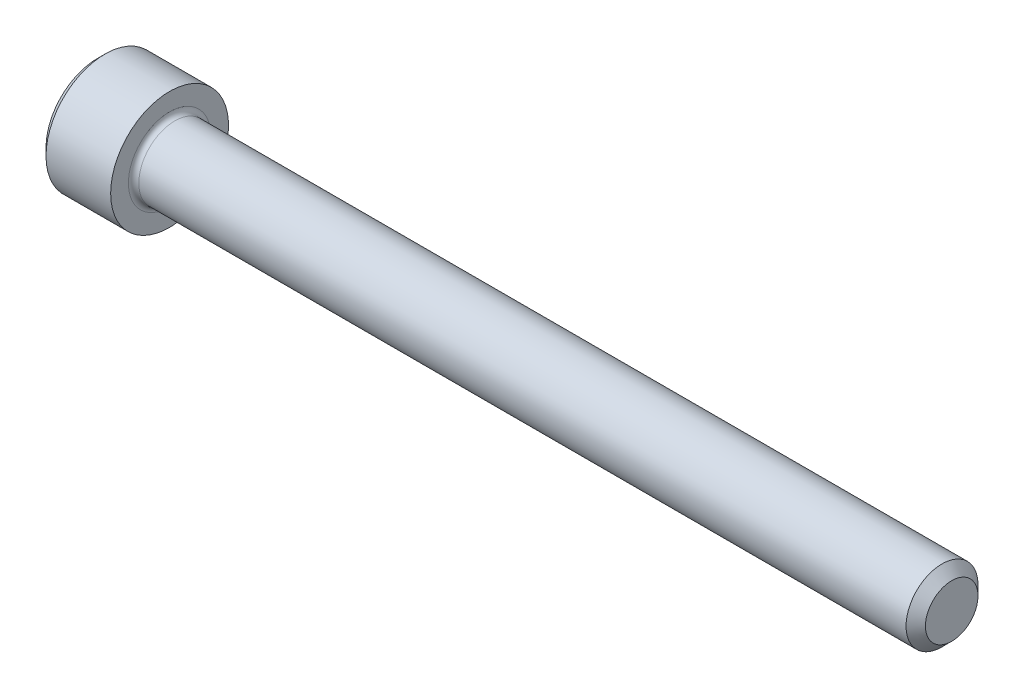
ISO-10303-21;
HEADER;
FILE_DESCRIPTION(('STEP AP214'),'2;1');
FILE_NAME('part.step','',(''),(''),'','','');
FILE_SCHEMA(('AUTOMOTIVE_DESIGN { 1 0 10303 214 1 1 1 1 }'));
ENDSEC;
DATA;
#1=APPLICATION_CONTEXT('core data for automotive mechanical design processes');
#2=APPLICATION_PROTOCOL_DEFINITION('international standard','automotive_design',2000,#1);
#3=PRODUCT_CONTEXT('',#1,'mechanical');
#4=PRODUCT('Part','Part','',(#3));
#5=PRODUCT_RELATED_PRODUCT_CATEGORY('part','',(#4));
#6=PRODUCT_DEFINITION_FORMATION('','',#4);
#7=PRODUCT_DEFINITION_CONTEXT('part definition',#1,'design');
#8=PRODUCT_DEFINITION('design','',#6,#7);
#9=PRODUCT_DEFINITION_SHAPE('','',#8);
#10=(LENGTH_UNIT() NAMED_UNIT(*) SI_UNIT(.MILLI.,.METRE.));
#11=(NAMED_UNIT(*) PLANE_ANGLE_UNIT() SI_UNIT($,.RADIAN.));
#12=(NAMED_UNIT(*) SI_UNIT($,.STERADIAN.) SOLID_ANGLE_UNIT());
#13=UNCERTAINTY_MEASURE_WITH_UNIT(LENGTH_MEASURE(1.E-05),#10,'distance_accuracy_value','');
#14=(GEOMETRIC_REPRESENTATION_CONTEXT(3) GLOBAL_UNCERTAINTY_ASSIGNED_CONTEXT((#13)) GLOBAL_UNIT_ASSIGNED_CONTEXT((#10,
#11,#12)) REPRESENTATION_CONTEXT('',''));
#15=CARTESIAN_POINT('',(0.,0.,0.));
#16=DIRECTION('',(0.,0.,1.));
#17=DIRECTION('',(1.,0.,0.));
#18=AXIS2_PLACEMENT_3D('',#15,#16,#17);
#19=CARTESIAN_POINT('',(0.,0.,0.));
#20=DIRECTION('',(-1.,0.,0.));
#21=DIRECTION('',(0.,0.,1.));
#22=AXIS2_PLACEMENT_3D('',#19,#20,#21);
#23=PLANE('',#22);
#24=DIRECTION('',(0.,-0.499999999999999,0.866025403784439));
#25=VECTOR('',#24,1.);
#26=CARTESIAN_POINT('',(0.,1.5984519552784,0.));
#27=LINE('',#26,#25);
#28=CARTESIAN_POINT('',(0.,1.5984519552784,0.));
#29=VERTEX_POINT('',#28);
#30=CARTESIAN_POINT('',(0.,0.799225977639205,1.3843));
#31=VERTEX_POINT('',#30);
#32=EDGE_CURVE('E384',#29,#31,#27,.T.);
#33=ORIENTED_EDGE('',*,*,#32,.T.);
#34=DIRECTION('',(0.,1.,0.));
#35=VECTOR('',#34,1.);
#36=CARTESIAN_POINT('',(0.,-0.799225977639191,1.3843));
#37=LINE('',#36,#35);
#38=CARTESIAN_POINT('',(0.,-0.799225977639191,1.3843));
#39=VERTEX_POINT('',#38);
#40=EDGE_CURVE('E128',#39,#31,#37,.T.);
#41=ORIENTED_EDGE('',*,*,#40,.F.);
#42=DIRECTION('',(0.,-0.500000000000001,-0.866025403784438));
#43=VECTOR('',#42,1.);
#44=CARTESIAN_POINT('',(0.,-0.799225977639191,1.3843));
#45=LINE('',#44,#43);
#46=CARTESIAN_POINT('',(0.,-1.59845195527839,0.));
#47=VERTEX_POINT('',#46);
#48=EDGE_CURVE('E387',#39,#47,#45,.T.);
#49=ORIENTED_EDGE('',*,*,#48,.T.);
#50=DIRECTION('',(0.,0.499999999999999,-0.86602540378444));
#51=VECTOR('',#50,1.);
#52=CARTESIAN_POINT('',(0.,-1.59845195527839,0.));
#53=LINE('',#52,#51);
#54=CARTESIAN_POINT('',(0.,-0.799225977639196,-1.3843));
#55=VERTEX_POINT('',#54);
#56=EDGE_CURVE('E390',#47,#55,#53,.T.);
#57=ORIENTED_EDGE('',*,*,#56,.T.);
#58=DIRECTION('',(0.,-1.,0.));
#59=VECTOR('',#58,1.);
#60=CARTESIAN_POINT('',(0.,0.799225977639202,-1.3843));
#61=LINE('',#60,#59);
#62=CARTESIAN_POINT('',(0.,0.799225977639202,-1.3843));
#63=VERTEX_POINT('',#62);
#64=EDGE_CURVE('E393',#63,#55,#61,.T.);
#65=ORIENTED_EDGE('',*,*,#64,.F.);
#66=DIRECTION('',(0.,-0.500000000000001,-0.866025403784438));
#67=VECTOR('',#66,1.);
#68=CARTESIAN_POINT('',(0.,1.5984519552784,0.));
#69=LINE('',#68,#67);
#70=EDGE_CURVE('E123',#29,#63,#69,.T.);
#71=ORIENTED_EDGE('',*,*,#70,.F.);
#72=EDGE_LOOP('',(#33,#41,#49,#57,#65,#71));
#73=FACE_BOUND('',#72,.T.);
#74=CARTESIAN_POINT('',(0.,0.,0.));
#75=DIRECTION('',(-1.,0.,0.));
#76=DIRECTION('',(0.,0.,1.));
#77=AXIS2_PLACEMENT_3D('',#74,#75,#76);
#78=CIRCLE('',#77,2.51460000000001);
#79=CARTESIAN_POINT('',(0.,0.,2.51460000000001));
#80=VERTEX_POINT('',#79);
#81=EDGE_CURVE('E139',#80,#80,#78,.T.);
#82=ORIENTED_EDGE('',*,*,#81,.T.);
#83=EDGE_LOOP('',(#82));
#84=FACE_BOUND('',#83,.T.);
#85=ADVANCED_FACE('F32',(#73,#84),#23,.T.);
#86=CARTESIAN_POINT('',(41.6052,1.28016,0.));
#87=DIRECTION('',(1.,0.,0.));
#88=DIRECTION('',(0.,0.,-1.));
#89=AXIS2_PLACEMENT_3D('',#86,#87,#88);
#90=PLANE('',#89);
#91=CARTESIAN_POINT('',(41.6052,0.,0.));
#92=DIRECTION('',(-1.,0.,0.));
#93=DIRECTION('',(0.,0.,1.));
#94=AXIS2_PLACEMENT_3D('',#91,#92,#93);
#95=CIRCLE('',#94,1.28016);
#96=CARTESIAN_POINT('',(41.6052,0.,1.28016));
#97=VERTEX_POINT('',#96);
#98=EDGE_CURVE('E152',#97,#97,#95,.T.);
#99=ORIENTED_EDGE('',*,*,#98,.F.);
#100=EDGE_LOOP('',(#99));
#101=FACE_BOUND('',#100,.T.);
#102=ADVANCED_FACE('F173',(#101),#90,.T.);
#103=CARTESIAN_POINT('',(41.6052,0.,0.));
#104=DIRECTION('',(-1.,0.,0.));
#105=DIRECTION('',(0.,0.,1.));
#106=AXIS2_PLACEMENT_3D('',#103,#104,#105);
#107=CONICAL_SURFACE('',#106,1.28016,0.785398163397443);
#108=CARTESIAN_POINT('',(41.13276,0.,0.));
#109=DIRECTION('',(-1.,0.,0.));
#110=DIRECTION('',(0.,0.,1.));
#111=AXIS2_PLACEMENT_3D('',#108,#109,#110);
#112=CIRCLE('',#111,1.7526);
#113=CARTESIAN_POINT('',(41.13276,0.,1.7526));
#114=VERTEX_POINT('',#113);
#115=EDGE_CURVE('E149',#114,#114,#112,.T.);
#116=ORIENTED_EDGE('',*,*,#115,.F.);
#117=EDGE_LOOP('',(#116));
#118=FACE_BOUND('',#117,.T.);
#119=ORIENTED_EDGE('',*,*,#98,.T.);
#120=EDGE_LOOP('',(#119));
#121=FACE_BOUND('',#120,.T.);
#122=ADVANCED_FACE('F179',(#118,#121),#107,.T.);
#123=CARTESIAN_POINT('',(-31.75,0.,0.));
#124=DIRECTION('',(-1.,0.,0.));
#125=DIRECTION('',(0.,0.,1.));
#126=AXIS2_PLACEMENT_3D('',#123,#124,#125);
#127=CYLINDRICAL_SURFACE('',#126,1.7526);
#128=CARTESIAN_POINT('',(3.7592,0.,0.));
#129=DIRECTION('',(1.,0.,0.));
#130=DIRECTION('',(0.,0.,-1.));
#131=AXIS2_PLACEMENT_3D('',#128,#129,#130);
#132=CIRCLE('',#131,1.7526);
#133=CARTESIAN_POINT('',(3.7592,0.,-1.7526));
#134=VERTEX_POINT('',#133);
#135=EDGE_CURVE('E11',#134,#134,#132,.T.);
#136=ORIENTED_EDGE('',*,*,#135,.T.);
#137=EDGE_LOOP('',(#136));
#138=FACE_BOUND('',#137,.T.);
#139=ORIENTED_EDGE('',*,*,#115,.T.);
#140=EDGE_LOOP('',(#139));
#141=FACE_BOUND('',#140,.T.);
#142=ADVANCED_FACE('F190',(#138,#141),#127,.T.);
#143=CARTESIAN_POINT('',(3.5052,2.8702,0.));
#144=DIRECTION('',(1.,0.,0.));
#145=DIRECTION('',(0.,0.,-1.));
#146=AXIS2_PLACEMENT_3D('',#143,#144,#145);
#147=PLANE('',#146);
#148=CARTESIAN_POINT('',(3.5052,0.,0.));
#149=DIRECTION('',(1.,0.,0.));
#150=DIRECTION('',(0.,0.,-1.));
#151=AXIS2_PLACEMENT_3D('',#148,#149,#150);
#152=CIRCLE('',#151,2.0066);
#153=CARTESIAN_POINT('',(3.5052,0.,-2.0066));
#154=VERTEX_POINT('',#153);
#155=EDGE_CURVE('E40',#154,#154,#152,.F.);
#156=ORIENTED_EDGE('',*,*,#155,.T.);
#157=EDGE_LOOP('',(#156));
#158=FACE_BOUND('',#157,.T.);
#159=CARTESIAN_POINT('',(3.5052,0.,0.));
#160=DIRECTION('',(-1.,0.,0.));
#161=DIRECTION('',(0.,0.,1.));
#162=AXIS2_PLACEMENT_3D('',#159,#160,#161);
#163=CIRCLE('',#162,2.8702);
#164=CARTESIAN_POINT('',(3.5052,0.,2.8702));
#165=VERTEX_POINT('',#164);
#166=EDGE_CURVE('E146',#165,#165,#163,.T.);
#167=ORIENTED_EDGE('',*,*,#166,.F.);
#168=EDGE_LOOP('',(#167));
#169=FACE_BOUND('',#168,.T.);
#170=ADVANCED_FACE('F157',(#158,#169),#147,.T.);
#171=CARTESIAN_POINT('',(-31.75,0.,0.));
#172=DIRECTION('',(-1.,0.,0.));
#173=DIRECTION('',(0.,0.,1.));
#174=AXIS2_PLACEMENT_3D('',#171,#172,#173);
#175=CYLINDRICAL_SURFACE('',#174,2.8702);
#176=ORIENTED_EDGE('',*,*,#166,.T.);
#177=EDGE_LOOP('',(#176));
#178=FACE_BOUND('',#177,.T.);
#179=CARTESIAN_POINT('',(0.355600000000005,0.,0.));
#180=DIRECTION('',(-1.,0.,0.));
#181=DIRECTION('',(0.,0.,1.));
#182=AXIS2_PLACEMENT_3D('',#179,#180,#181);
#183=CIRCLE('',#182,2.8702);
#184=CARTESIAN_POINT('',(0.355600000000005,0.,2.8702));
#185=VERTEX_POINT('',#184);
#186=EDGE_CURVE('E143',#185,#185,#183,.T.);
#187=ORIENTED_EDGE('',*,*,#186,.F.);
#188=EDGE_LOOP('',(#187));
#189=FACE_BOUND('',#188,.T.);
#190=ADVANCED_FACE('F168',(#178,#189),#175,.T.);
#191=CARTESIAN_POINT('',(0.,0.,0.));
#192=DIRECTION('',(1.,0.,0.));
#193=DIRECTION('',(0.,0.,-1.));
#194=AXIS2_PLACEMENT_3D('',#191,#192,#193);
#195=CONICAL_SURFACE('',#194,2.51460000000001,0.785398163397436);
#196=ORIENTED_EDGE('',*,*,#186,.T.);
#197=EDGE_LOOP('',(#196));
#198=FACE_BOUND('',#197,.T.);
#199=ORIENTED_EDGE('',*,*,#81,.F.);
#200=EDGE_LOOP('',(#199));
#201=FACE_BOUND('',#200,.T.);
#202=ADVANCED_FACE('F161',(#198,#201),#195,.T.);
#203=CARTESIAN_POINT('',(3.7592,0.,0.));
#204=DIRECTION('',(1.,0.,0.));
#205=DIRECTION('',(0.,0.,-1.));
#206=AXIS2_PLACEMENT_3D('',#203,#204,#205);
#207=TOROIDAL_SURFACE('',#206,2.0066,0.254);
#208=ORIENTED_EDGE('',*,*,#135,.F.);
#209=EDGE_LOOP('',(#208));
#210=FACE_BOUND('',#209,.T.);
#211=ORIENTED_EDGE('',*,*,#155,.F.);
#212=EDGE_LOOP('',(#211));
#213=FACE_BOUND('',#212,.T.);
#214=ADVANCED_FACE('F34',(#210,#213),#207,.F.);
#215=CARTESIAN_POINT('',(1.6256,1.5984519552784,0.));
#216=DIRECTION('',(0.,-0.866025403784439,-0.499999999999999));
#217=DIRECTION('',(0.,0.499999999999999,-0.866025403784439));
#218=AXIS2_PLACEMENT_3D('',#215,#216,#217);
#219=PLANE('',#218);
#220=ORIENTED_EDGE('',*,*,#32,.F.);
#221=DIRECTION('',(-1.,0.,0.));
#222=VECTOR('',#221,1.);
#223=CARTESIAN_POINT('',(1.6256,1.5984519552784,0.));
#224=LINE('',#223,#222);
#225=CARTESIAN_POINT('',(1.6256,1.5984519552784,0.));
#226=VERTEX_POINT('',#225);
#227=EDGE_CURVE('E374',#226,#29,#224,.T.);
#228=ORIENTED_EDGE('',*,*,#227,.F.);
#229=DIRECTION('',(0.,-0.499999999999999,0.866025403784439));
#230=VECTOR('',#229,1.);
#231=CARTESIAN_POINT('',(1.6256,1.5984519552784,0.));
#232=LINE('',#231,#230);
#233=CARTESIAN_POINT('',(1.6256,1.1988389664588,0.692150000000001));
#234=VERTEX_POINT('',#233);
#235=EDGE_CURVE('E115',#226,#234,#232,.T.);
#236=ORIENTED_EDGE('',*,*,#235,.T.);
#237=CARTESIAN_POINT('',(1.6256,0.799225977639205,1.3843));
#238=VERTEX_POINT('',#237);
#239=EDGE_CURVE('E106',#234,#238,#232,.T.);
#240=ORIENTED_EDGE('',*,*,#239,.T.);
#241=DIRECTION('',(-1.,0.,0.));
#242=VECTOR('',#241,1.);
#243=CARTESIAN_POINT('',(1.6256,0.799225977639205,1.3843));
#244=LINE('',#243,#242);
#245=EDGE_CURVE('E120',#238,#31,#244,.T.);
#246=ORIENTED_EDGE('',*,*,#245,.T.);
#247=EDGE_LOOP('',(#220,#228,#236,#240,#246));
#248=FACE_BOUND('',#247,.T.);
#249=ADVANCED_FACE('F119',(#248),#219,.T.);
#250=CARTESIAN_POINT('',(1.6256,-0.799225977639191,1.3843));
#251=DIRECTION('',(0.,0.,1.));
#252=DIRECTION('',(0.,-1.,0.));
#253=AXIS2_PLACEMENT_3D('',#250,#251,#252);
#254=PLANE('',#253);
#255=ORIENTED_EDGE('',*,*,#40,.T.);
#256=ORIENTED_EDGE('',*,*,#245,.F.);
#257=DIRECTION('',(0.,1.,0.));
#258=VECTOR('',#257,1.);
#259=CARTESIAN_POINT('',(1.6256,-0.799225977639191,1.3843));
#260=LINE('',#259,#258);
#261=CARTESIAN_POINT('',(1.6256,0.,1.3843));
#262=VERTEX_POINT('',#261);
#263=EDGE_CURVE('E103',#262,#238,#260,.T.);
#264=ORIENTED_EDGE('',*,*,#263,.F.);
#265=CARTESIAN_POINT('',(1.6256,-0.799225977639191,1.3843));
#266=VERTEX_POINT('',#265);
#267=EDGE_CURVE('E114',#266,#262,#260,.T.);
#268=ORIENTED_EDGE('',*,*,#267,.F.);
#269=DIRECTION('',(-1.,0.,0.));
#270=VECTOR('',#269,1.);
#271=CARTESIAN_POINT('',(1.6256,-0.799225977639191,1.3843));
#272=LINE('',#271,#270);
#273=EDGE_CURVE('E130',#266,#39,#272,.T.);
#274=ORIENTED_EDGE('',*,*,#273,.T.);
#275=EDGE_LOOP('',(#255,#256,#264,#268,#274));
#276=FACE_BOUND('',#275,.T.);
#277=ADVANCED_FACE('F125',(#276),#254,.F.);
#278=CARTESIAN_POINT('',(1.6256,-0.799225977639191,1.3843));
#279=DIRECTION('',(0.,0.866025403784438,-0.500000000000001));
#280=DIRECTION('',(0.,0.500000000000001,0.866025403784438));
#281=AXIS2_PLACEMENT_3D('',#278,#279,#280);
#282=PLANE('',#281);
#283=ORIENTED_EDGE('',*,*,#48,.F.);
#284=ORIENTED_EDGE('',*,*,#273,.F.);
#285=DIRECTION('',(0.,-0.500000000000001,-0.866025403784438));
#286=VECTOR('',#285,1.);
#287=CARTESIAN_POINT('',(1.6256,-0.799225977639191,1.3843));
#288=LINE('',#287,#286);
#289=CARTESIAN_POINT('',(1.6256,-1.19883896645879,0.692149999999999));
#290=VERTEX_POINT('',#289);
#291=EDGE_CURVE('E413',#266,#290,#288,.T.);
#292=ORIENTED_EDGE('',*,*,#291,.T.);
#293=CARTESIAN_POINT('',(1.6256,-1.59845195527839,0.));
#294=VERTEX_POINT('',#293);
#295=EDGE_CURVE('E402',#290,#294,#288,.T.);
#296=ORIENTED_EDGE('',*,*,#295,.T.);
#297=DIRECTION('',(-1.,0.,0.));
#298=VECTOR('',#297,1.);
#299=CARTESIAN_POINT('',(1.6256,-1.59845195527839,0.));
#300=LINE('',#299,#298);
#301=EDGE_CURVE('E135',#294,#47,#300,.T.);
#302=ORIENTED_EDGE('',*,*,#301,.T.);
#303=EDGE_LOOP('',(#283,#284,#292,#296,#302));
#304=FACE_BOUND('',#303,.T.);
#305=ADVANCED_FACE('F265',(#304),#282,.T.);
#306=CARTESIAN_POINT('',(1.6256,-1.59845195527839,0.));
#307=DIRECTION('',(0.,0.866025403784439,0.499999999999999));
#308=DIRECTION('',(0.,-0.499999999999999,0.866025403784439));
#309=AXIS2_PLACEMENT_3D('',#306,#307,#308);
#310=PLANE('',#309);
#311=ORIENTED_EDGE('',*,*,#56,.F.);
#312=ORIENTED_EDGE('',*,*,#301,.F.);
#313=DIRECTION('',(0.,0.499999999999999,-0.86602540378444));
#314=VECTOR('',#313,1.);
#315=CARTESIAN_POINT('',(1.6256,-1.59845195527839,0.));
#316=LINE('',#315,#314);
#317=CARTESIAN_POINT('',(1.6256,-1.1988389664588,-0.692149999999996));
#318=VERTEX_POINT('',#317);
#319=EDGE_CURVE('E380',#294,#318,#316,.T.);
#320=ORIENTED_EDGE('',*,*,#319,.T.);
#321=CARTESIAN_POINT('',(1.6256,-0.799225977639196,-1.3843));
#322=VERTEX_POINT('',#321);
#323=EDGE_CURVE('E412',#318,#322,#316,.T.);
#324=ORIENTED_EDGE('',*,*,#323,.T.);
#325=DIRECTION('',(-1.,0.,0.));
#326=VECTOR('',#325,1.);
#327=CARTESIAN_POINT('',(1.6256,-0.799225977639196,-1.3843));
#328=LINE('',#327,#326);
#329=EDGE_CURVE('E373',#322,#55,#328,.T.);
#330=ORIENTED_EDGE('',*,*,#329,.T.);
#331=EDGE_LOOP('',(#311,#312,#320,#324,#330));
#332=FACE_BOUND('',#331,.T.);
#333=ADVANCED_FACE('F273',(#332),#310,.T.);
#334=CARTESIAN_POINT('',(1.6256,0.799225977639202,-1.3843));
#335=DIRECTION('',(0.,0.,-1.));
#336=DIRECTION('',(0.,1.,0.));
#337=AXIS2_PLACEMENT_3D('',#334,#335,#336);
#338=PLANE('',#337);
#339=ORIENTED_EDGE('',*,*,#64,.T.);
#340=ORIENTED_EDGE('',*,*,#329,.F.);
#341=DIRECTION('',(0.,-1.,0.));
#342=VECTOR('',#341,1.);
#343=CARTESIAN_POINT('',(1.6256,0.799225977639202,-1.3843));
#344=LINE('',#343,#342);
#345=CARTESIAN_POINT('',(1.6256,0.,-1.3843));
#346=VERTEX_POINT('',#345);
#347=EDGE_CURVE('E377',#346,#322,#344,.T.);
#348=ORIENTED_EDGE('',*,*,#347,.F.);
#349=CARTESIAN_POINT('',(1.6256,0.799225977639202,-1.3843));
#350=VERTEX_POINT('',#349);
#351=EDGE_CURVE('E47',#350,#346,#344,.T.);
#352=ORIENTED_EDGE('',*,*,#351,.F.);
#353=DIRECTION('',(-1.,0.,0.));
#354=VECTOR('',#353,1.);
#355=CARTESIAN_POINT('',(1.6256,0.799225977639202,-1.3843));
#356=LINE('',#355,#354);
#357=EDGE_CURVE('E370',#350,#63,#356,.T.);
#358=ORIENTED_EDGE('',*,*,#357,.T.);
#359=EDGE_LOOP('',(#339,#340,#348,#352,#358));
#360=FACE_BOUND('',#359,.T.);
#361=ADVANCED_FACE('F282',(#360),#338,.F.);
#362=CARTESIAN_POINT('',(1.6256,1.5984519552784,0.));
#363=DIRECTION('',(0.,0.866025403784438,-0.500000000000001));
#364=DIRECTION('',(0.,0.500000000000001,0.866025403784438));
#365=AXIS2_PLACEMENT_3D('',#362,#363,#364);
#366=PLANE('',#365);
#367=ORIENTED_EDGE('',*,*,#70,.T.);
#368=ORIENTED_EDGE('',*,*,#357,.F.);
#369=DIRECTION('',(0.,-0.500000000000001,-0.866025403784438));
#370=VECTOR('',#369,1.);
#371=CARTESIAN_POINT('',(1.6256,1.5984519552784,0.));
#372=LINE('',#371,#370);
#373=CARTESIAN_POINT('',(1.6256,1.1988389664588,-0.692150000000004));
#374=VERTEX_POINT('',#373);
#375=EDGE_CURVE('E360',#374,#350,#372,.T.);
#376=ORIENTED_EDGE('',*,*,#375,.F.);
#377=EDGE_CURVE('E366',#226,#374,#372,.T.);
#378=ORIENTED_EDGE('',*,*,#377,.F.);
#379=ORIENTED_EDGE('',*,*,#227,.T.);
#380=EDGE_LOOP('',(#367,#368,#376,#378,#379));
#381=FACE_BOUND('',#380,.T.);
#382=ADVANCED_FACE('F291',(#381),#366,.F.);
#383=CARTESIAN_POINT('',(1.6256,0.,2.7686));
#384=DIRECTION('',(1.,0.,0.));
#385=DIRECTION('',(0.,0.,-1.));
#386=AXIS2_PLACEMENT_3D('',#383,#384,#385);
#387=PLANE('',#386);
#388=ORIENTED_EDGE('',*,*,#347,.T.);
#389=ORIENTED_EDGE('',*,*,#323,.F.);
#390=CARTESIAN_POINT('',(1.6256,0.,0.));
#391=DIRECTION('',(-1.,0.,0.));
#392=DIRECTION('',(0.,0.,1.));
#393=AXIS2_PLACEMENT_3D('',#390,#391,#392);
#394=CIRCLE('',#393,1.3843);
#395=EDGE_CURVE('E408',#346,#318,#394,.T.);
#396=ORIENTED_EDGE('',*,*,#395,.F.);
#397=EDGE_LOOP('',(#388,#389,#396));
#398=FACE_BOUND('',#397,.T.);
#399=ADVANCED_FACE('F300',(#398),#387,.F.);
#400=ORIENTED_EDGE('',*,*,#319,.F.);
#401=ORIENTED_EDGE('',*,*,#295,.F.);
#402=EDGE_CURVE('E133',#318,#290,#394,.T.);
#403=ORIENTED_EDGE('',*,*,#402,.F.);
#404=EDGE_LOOP('',(#400,#401,#403));
#405=FACE_BOUND('',#404,.T.);
#406=ADVANCED_FACE('F309',(#405),#387,.F.);
#407=ORIENTED_EDGE('',*,*,#291,.F.);
#408=ORIENTED_EDGE('',*,*,#267,.T.);
#409=EDGE_CURVE('E129',#290,#262,#394,.T.);
#410=ORIENTED_EDGE('',*,*,#409,.F.);
#411=EDGE_LOOP('',(#407,#408,#410));
#412=FACE_BOUND('',#411,.T.);
#413=ADVANCED_FACE('F318',(#412),#387,.F.);
#414=ORIENTED_EDGE('',*,*,#263,.T.);
#415=ORIENTED_EDGE('',*,*,#239,.F.);
#416=EDGE_CURVE('E109',#262,#234,#394,.T.);
#417=ORIENTED_EDGE('',*,*,#416,.F.);
#418=EDGE_LOOP('',(#414,#415,#417));
#419=FACE_BOUND('',#418,.T.);
#420=ADVANCED_FACE('F105',(#419),#387,.F.);
#421=ORIENTED_EDGE('',*,*,#235,.F.);
#422=ORIENTED_EDGE('',*,*,#377,.T.);
#423=EDGE_CURVE('E140',#234,#374,#394,.T.);
#424=ORIENTED_EDGE('',*,*,#423,.F.);
#425=EDGE_LOOP('',(#421,#422,#424));
#426=FACE_BOUND('',#425,.T.);
#427=ADVANCED_FACE('F333',(#426),#387,.F.);
#428=ORIENTED_EDGE('',*,*,#375,.T.);
#429=ORIENTED_EDGE('',*,*,#351,.T.);
#430=EDGE_CURVE('E363',#374,#346,#394,.T.);
#431=ORIENTED_EDGE('',*,*,#430,.F.);
#432=EDGE_LOOP('',(#428,#429,#431));
#433=FACE_BOUND('',#432,.T.);
#434=ADVANCED_FACE('F248',(#433),#387,.F.);
#435=CARTESIAN_POINT('',(1.6256,0.,0.));
#436=DIRECTION('',(-1.,0.,0.));
#437=DIRECTION('',(0.,0.,1.));
#438=AXIS2_PLACEMENT_3D('',#435,#436,#437);
#439=CONICAL_SURFACE('',#438,1.3843,1.04719755119659);
#440=CARTESIAN_POINT('',(2.4248259776392,0.,0.));
#441=VERTEX_POINT('',#440);
#442=VERTEX_LOOP('',#441);
#443=FACE_BOUND('',#442,.T.);
#444=ORIENTED_EDGE('',*,*,#416,.T.);
#445=ORIENTED_EDGE('',*,*,#423,.T.);
#446=ORIENTED_EDGE('',*,*,#430,.T.);
#447=ORIENTED_EDGE('',*,*,#395,.T.);
#448=ORIENTED_EDGE('',*,*,#402,.T.);
#449=ORIENTED_EDGE('',*,*,#409,.T.);
#450=EDGE_LOOP('',(#444,#445,#446,#447,#448,#449));
#451=FACE_BOUND('',#450,.T.);
#452=ADVANCED_FACE('F183',(#443,#451),#439,.F.);
#453=CLOSED_SHELL('',(#85,#102,#122,#142,#170,#190,#202,#214,#249,#277,#305,#333,#361,#382,#399,
#406,#413,#420,#427,#434,#452));
#454=MANIFOLD_SOLID_BREP('B2',#453);
#455=ADVANCED_BREP_SHAPE_REPRESENTATION('',(#18,#454),#14);
#456=SHAPE_DEFINITION_REPRESENTATION(#9,#455);
ENDSEC;
END-ISO-10303-21;
